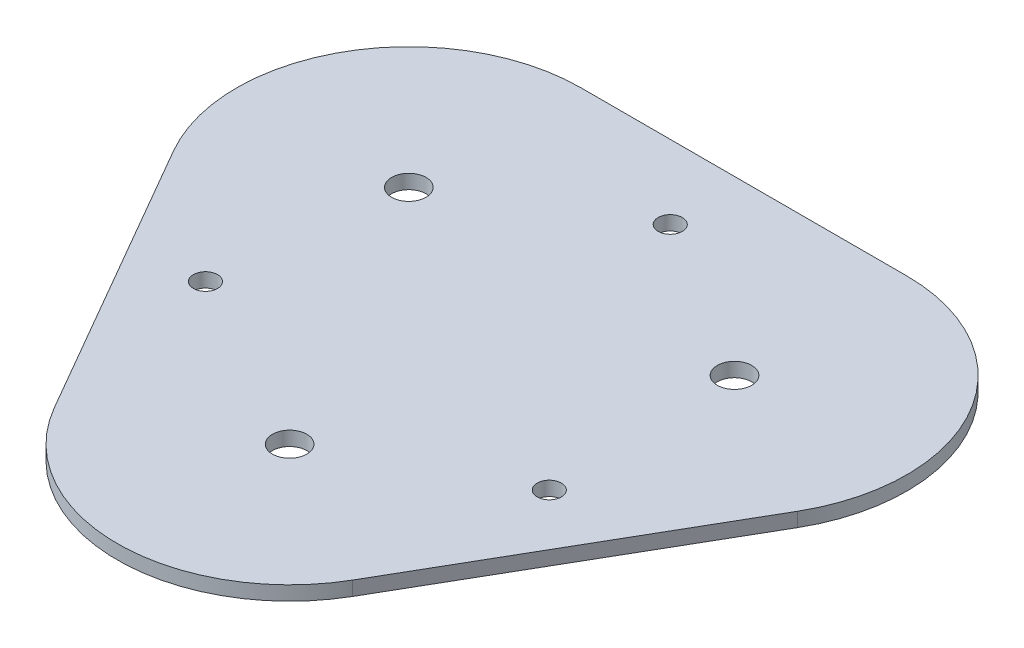
ISO-10303-21;
HEADER;
FILE_DESCRIPTION(('STEP AP214'),'2;1');
FILE_NAME('part.step','',(''),(''),'','','');
FILE_SCHEMA(('AUTOMOTIVE_DESIGN { 1 0 10303 214 1 1 1 1 }'));
ENDSEC;
DATA;
#1=APPLICATION_CONTEXT('core data for automotive mechanical design processes');
#2=APPLICATION_PROTOCOL_DEFINITION('international standard','automotive_design',2000,#1);
#3=PRODUCT_CONTEXT('',#1,'mechanical');
#4=PRODUCT('Part','Part','',(#3));
#5=PRODUCT_RELATED_PRODUCT_CATEGORY('part','',(#4));
#6=PRODUCT_DEFINITION_FORMATION('','',#4);
#7=PRODUCT_DEFINITION_CONTEXT('part definition',#1,'design');
#8=PRODUCT_DEFINITION('design','',#6,#7);
#9=PRODUCT_DEFINITION_SHAPE('','',#8);
#10=(LENGTH_UNIT() NAMED_UNIT(*) SI_UNIT(.MILLI.,.METRE.));
#11=(NAMED_UNIT(*) PLANE_ANGLE_UNIT() SI_UNIT($,.RADIAN.));
#12=(NAMED_UNIT(*) SI_UNIT($,.STERADIAN.) SOLID_ANGLE_UNIT());
#13=UNCERTAINTY_MEASURE_WITH_UNIT(LENGTH_MEASURE(1.E-05),#10,'distance_accuracy_value','');
#14=(GEOMETRIC_REPRESENTATION_CONTEXT(3) GLOBAL_UNCERTAINTY_ASSIGNED_CONTEXT((#13)) GLOBAL_UNIT_ASSIGNED_CONTEXT((#10,
#11,#12)) REPRESENTATION_CONTEXT('',''));
#15=CARTESIAN_POINT('',(0.,0.,0.));
#16=DIRECTION('',(0.,0.,1.));
#17=DIRECTION('',(1.,0.,0.));
#18=AXIS2_PLACEMENT_3D('',#15,#16,#17);
#19=CARTESIAN_POINT('',(-18.9035,1.65,-10.9139408136261));
#20=DIRECTION('',(0.,1.,0.));
#21=DIRECTION('',(0.,0.,1.));
#22=AXIS2_PLACEMENT_3D('',#19,#20,#21);
#23=PLANE('',#22);
#24=CARTESIAN_POINT('',(19.6802540959206,1.65,11.3624));
#25=DIRECTION('',(0.,1.,0.));
#26=DIRECTION('',(0.,0.,1.));
#27=AXIS2_PLACEMENT_3D('',#24,#25,#26);
#28=CIRCLE('',#27,1.4);
#29=CARTESIAN_POINT('',(19.6802540959206,1.65,12.7624));
#30=VERTEX_POINT('',#29);
#31=EDGE_CURVE('E181',#30,#30,#28,.T.);
#32=ORIENTED_EDGE('',*,*,#31,.F.);
#33=EDGE_LOOP('',(#32));
#34=FACE_BOUND('',#33,.T.);
#35=CARTESIAN_POINT('',(0.,1.65,21.8278816272522));
#36=DIRECTION('',(0.,1.,0.));
#37=DIRECTION('',(0.,0.,1.));
#38=AXIS2_PLACEMENT_3D('',#35,#36,#37);
#39=CIRCLE('',#38,2.);
#40=CARTESIAN_POINT('',(0.,1.65,23.8278816272522));
#41=VERTEX_POINT('',#40);
#42=EDGE_CURVE('E169',#41,#41,#39,.T.);
#43=ORIENTED_EDGE('',*,*,#42,.F.);
#44=EDGE_LOOP('',(#43));
#45=FACE_BOUND('',#44,.T.);
#46=CARTESIAN_POINT('',(-18.9035,1.65,-10.9139408136261));
#47=DIRECTION('',(0.,1.,0.));
#48=DIRECTION('',(0.,0.,1.));
#49=AXIS2_PLACEMENT_3D('',#46,#47,#48);
#50=CIRCLE('',#49,2.);
#51=CARTESIAN_POINT('',(-18.9035,1.65,-8.91394081362609));
#52=VERTEX_POINT('',#51);
#53=EDGE_CURVE('E134',#52,#52,#50,.T.);
#54=ORIENTED_EDGE('',*,*,#53,.F.);
#55=EDGE_LOOP('',(#54));
#56=FACE_BOUND('',#55,.T.);
#57=CARTESIAN_POINT('',(-18.9035,1.65,-10.9139408136261));
#58=DIRECTION('',(0.,1.,0.));
#59=DIRECTION('',(0.,0.,1.));
#60=AXIS2_PLACEMENT_3D('',#57,#58,#59);
#61=CIRCLE('',#60,20.);
#62=CARTESIAN_POINT('',(-18.9035,1.65,-30.9139408136261));
#63=VERTEX_POINT('',#62);
#64=CARTESIAN_POINT('',(-36.2240080756888,1.65,-0.913940813626082));
#65=VERTEX_POINT('',#64);
#66=EDGE_CURVE('E142',#63,#65,#61,.T.);
#67=ORIENTED_EDGE('',*,*,#66,.T.);
#68=DIRECTION('',(0.5,0.,0.866025403784438));
#69=VECTOR('',#68,1.);
#70=CARTESIAN_POINT('',(-36.2240080756888,1.65,-0.913940813626082));
#71=LINE('',#70,#69);
#72=CARTESIAN_POINT('',(-17.3205080756888,1.65,31.8278816272522));
#73=VERTEX_POINT('',#72);
#74=EDGE_CURVE('E92',#65,#73,#71,.T.);
#75=ORIENTED_EDGE('',*,*,#74,.T.);
#76=CARTESIAN_POINT('',(0.,1.65,21.8278816272522));
#77=DIRECTION('',(0.,1.,0.));
#78=DIRECTION('',(0.,0.,1.));
#79=AXIS2_PLACEMENT_3D('',#76,#77,#78);
#80=CIRCLE('',#79,20.);
#81=CARTESIAN_POINT('',(17.3205080756888,1.65,31.8278816272522));
#82=VERTEX_POINT('',#81);
#83=EDGE_CURVE('E109',#73,#82,#80,.T.);
#84=ORIENTED_EDGE('',*,*,#83,.T.);
#85=DIRECTION('',(0.5,0.,-0.866025403784439));
#86=VECTOR('',#85,1.);
#87=CARTESIAN_POINT('',(36.2240080756888,1.65,-0.913940813626094));
#88=LINE('',#87,#86);
#89=CARTESIAN_POINT('',(36.2240080756888,1.65,-0.913940813626094));
#90=VERTEX_POINT('',#89);
#91=EDGE_CURVE('E102',#82,#90,#88,.T.);
#92=ORIENTED_EDGE('',*,*,#91,.T.);
#93=CARTESIAN_POINT('',(18.9035,1.65,-10.9139408136261));
#94=DIRECTION('',(0.,1.,0.));
#95=DIRECTION('',(0.,0.,1.));
#96=AXIS2_PLACEMENT_3D('',#93,#94,#95);
#97=CIRCLE('',#96,20.);
#98=CARTESIAN_POINT('',(18.9035,1.65,-30.9139408136261));
#99=VERTEX_POINT('',#98);
#100=EDGE_CURVE('E106',#90,#99,#97,.T.);
#101=ORIENTED_EDGE('',*,*,#100,.T.);
#102=DIRECTION('',(-1.,0.,0.));
#103=VECTOR('',#102,1.);
#104=CARTESIAN_POINT('',(-18.9035,1.65,-30.9139408136261));
#105=LINE('',#104,#103);
#106=EDGE_CURVE('E57',#99,#63,#105,.T.);
#107=ORIENTED_EDGE('',*,*,#106,.T.);
#108=EDGE_LOOP('',(#67,#75,#84,#92,#101,#107));
#109=FACE_BOUND('',#108,.T.);
#110=CARTESIAN_POINT('',(18.9035,1.65,-10.9139408136261));
#111=DIRECTION('',(0.,1.,0.));
#112=DIRECTION('',(0.,0.,1.));
#113=AXIS2_PLACEMENT_3D('',#110,#111,#112);
#114=CIRCLE('',#113,2.);
#115=CARTESIAN_POINT('',(18.9035,1.65,-8.9139408136261));
#116=VERTEX_POINT('',#115);
#117=EDGE_CURVE('E163',#116,#116,#114,.T.);
#118=ORIENTED_EDGE('',*,*,#117,.F.);
#119=EDGE_LOOP('',(#118));
#120=FACE_BOUND('',#119,.T.);
#121=CARTESIAN_POINT('',(-21.2385033140493,1.65,10.358710198626));
#122=DIRECTION('',(0.,1.,0.));
#123=DIRECTION('',(0.,0.,1.));
#124=AXIS2_PLACEMENT_3D('',#121,#122,#123);
#125=CIRCLE('',#124,1.4);
#126=CARTESIAN_POINT('',(-21.2385033140493,1.65,11.758710198626));
#127=VERTEX_POINT('',#126);
#128=EDGE_CURVE('E175',#127,#127,#125,.T.);
#129=ORIENTED_EDGE('',*,*,#128,.F.);
#130=EDGE_LOOP('',(#129));
#131=FACE_BOUND('',#130,.T.);
#132=CARTESIAN_POINT('',(0.,1.65,-22.3558));
#133=DIRECTION('',(0.,1.,0.));
#134=DIRECTION('',(0.,0.,1.));
#135=AXIS2_PLACEMENT_3D('',#132,#133,#134);
#136=CIRCLE('',#135,1.4);
#137=CARTESIAN_POINT('',(0.,1.65,-20.9558));
#138=VERTEX_POINT('',#137);
#139=EDGE_CURVE('E187',#138,#138,#136,.T.);
#140=ORIENTED_EDGE('',*,*,#139,.F.);
#141=EDGE_LOOP('',(#140));
#142=FACE_BOUND('',#141,.T.);
#143=ADVANCED_FACE('F33',(#34,#45,#56,#109,#120,#131,#142),#23,.T.);
#144=CARTESIAN_POINT('',(-18.9035,0.,-10.9139408136261));
#145=DIRECTION('',(0.,1.,0.));
#146=DIRECTION('',(0.,0.,1.));
#147=AXIS2_PLACEMENT_3D('',#144,#145,#146);
#148=PLANE('',#147);
#149=DIRECTION('',(-1.,0.,0.));
#150=VECTOR('',#149,1.);
#151=CARTESIAN_POINT('',(2.5,0.,-1.5));
#152=LINE('',#151,#150);
#153=CARTESIAN_POINT('',(2.5,0.,-1.5));
#154=VERTEX_POINT('',#153);
#155=CARTESIAN_POINT('',(-2.5,0.,-1.5));
#156=VERTEX_POINT('',#155);
#157=EDGE_CURVE('E206',#154,#156,#152,.T.);
#158=ORIENTED_EDGE('',*,*,#157,.T.);
#159=DIRECTION('',(0.,0.,1.));
#160=VECTOR('',#159,1.);
#161=CARTESIAN_POINT('',(-2.5,0.,-1.5));
#162=LINE('',#161,#160);
#163=CARTESIAN_POINT('',(-2.5,0.,1.5));
#164=VERTEX_POINT('',#163);
#165=EDGE_CURVE('E214',#156,#164,#162,.T.);
#166=ORIENTED_EDGE('',*,*,#165,.T.);
#167=DIRECTION('',(1.,0.,0.));
#168=VECTOR('',#167,1.);
#169=CARTESIAN_POINT('',(-2.5,0.,1.5));
#170=LINE('',#169,#168);
#171=CARTESIAN_POINT('',(2.5,0.,1.5));
#172=VERTEX_POINT('',#171);
#173=EDGE_CURVE('E211',#164,#172,#170,.T.);
#174=ORIENTED_EDGE('',*,*,#173,.T.);
#175=DIRECTION('',(0.,0.,-1.));
#176=VECTOR('',#175,1.);
#177=CARTESIAN_POINT('',(2.5,0.,1.5));
#178=LINE('',#177,#176);
#179=EDGE_CURVE('E48',#172,#154,#178,.T.);
#180=ORIENTED_EDGE('',*,*,#179,.T.);
#181=EDGE_LOOP('',(#158,#166,#174,#180));
#182=FACE_BOUND('',#181,.T.);
#183=CARTESIAN_POINT('',(-18.9035,0.,-10.9139408136261));
#184=DIRECTION('',(0.,1.,0.));
#185=DIRECTION('',(0.,0.,1.));
#186=AXIS2_PLACEMENT_3D('',#183,#184,#185);
#187=CIRCLE('',#186,20.);
#188=CARTESIAN_POINT('',(-18.9035,0.,-30.9139408136261));
#189=VERTEX_POINT('',#188);
#190=CARTESIAN_POINT('',(-36.2240080756888,0.,-0.913940813626082));
#191=VERTEX_POINT('',#190);
#192=EDGE_CURVE('E130',#189,#191,#187,.T.);
#193=ORIENTED_EDGE('',*,*,#192,.F.);
#194=DIRECTION('',(-1.,0.,0.));
#195=VECTOR('',#194,1.);
#196=CARTESIAN_POINT('',(-18.9035,0.,-30.9139408136261));
#197=LINE('',#196,#195);
#198=CARTESIAN_POINT('',(18.9035,0.,-30.9139408136261));
#199=VERTEX_POINT('',#198);
#200=EDGE_CURVE('E84',#199,#189,#197,.T.);
#201=ORIENTED_EDGE('',*,*,#200,.F.);
#202=CARTESIAN_POINT('',(18.9035,0.,-10.9139408136261));
#203=DIRECTION('',(0.,1.,0.));
#204=DIRECTION('',(0.,0.,1.));
#205=AXIS2_PLACEMENT_3D('',#202,#203,#204);
#206=CIRCLE('',#205,20.);
#207=CARTESIAN_POINT('',(36.2240080756888,0.,-0.913940813626094));
#208=VERTEX_POINT('',#207);
#209=EDGE_CURVE('E139',#208,#199,#206,.T.);
#210=ORIENTED_EDGE('',*,*,#209,.F.);
#211=DIRECTION('',(0.5,0.,-0.866025403784439));
#212=VECTOR('',#211,1.);
#213=CARTESIAN_POINT('',(36.2240080756888,0.,-0.913940813626094));
#214=LINE('',#213,#212);
#215=CARTESIAN_POINT('',(17.3205080756888,0.,31.8278816272522));
#216=VERTEX_POINT('',#215);
#217=EDGE_CURVE('E118',#216,#208,#214,.T.);
#218=ORIENTED_EDGE('',*,*,#217,.F.);
#219=CARTESIAN_POINT('',(0.,0.,21.8278816272522));
#220=DIRECTION('',(0.,1.,0.));
#221=DIRECTION('',(0.,0.,1.));
#222=AXIS2_PLACEMENT_3D('',#219,#220,#221);
#223=CIRCLE('',#222,20.);
#224=CARTESIAN_POINT('',(-17.3205080756888,0.,31.8278816272522));
#225=VERTEX_POINT('',#224);
#226=EDGE_CURVE('E136',#225,#216,#223,.T.);
#227=ORIENTED_EDGE('',*,*,#226,.F.);
#228=DIRECTION('',(0.5,0.,0.866025403784438));
#229=VECTOR('',#228,1.);
#230=CARTESIAN_POINT('',(-36.2240080756888,0.,-0.913940813626082));
#231=LINE('',#230,#229);
#232=EDGE_CURVE('E133',#191,#225,#231,.T.);
#233=ORIENTED_EDGE('',*,*,#232,.F.);
#234=EDGE_LOOP('',(#193,#201,#210,#218,#227,#233));
#235=FACE_BOUND('',#234,.T.);
#236=CARTESIAN_POINT('',(-18.9035,0.,-10.9139408136261));
#237=DIRECTION('',(0.,1.,0.));
#238=DIRECTION('',(0.,0.,1.));
#239=AXIS2_PLACEMENT_3D('',#236,#237,#238);
#240=CIRCLE('',#239,2.);
#241=CARTESIAN_POINT('',(-18.9035,0.,-8.91394081362609));
#242=VERTEX_POINT('',#241);
#243=EDGE_CURVE('E160',#242,#242,#240,.T.);
#244=ORIENTED_EDGE('',*,*,#243,.T.);
#245=EDGE_LOOP('',(#244));
#246=FACE_BOUND('',#245,.T.);
#247=CARTESIAN_POINT('',(18.9035,0.,-10.9139408136261));
#248=DIRECTION('',(0.,1.,0.));
#249=DIRECTION('',(0.,0.,1.));
#250=AXIS2_PLACEMENT_3D('',#247,#248,#249);
#251=CIRCLE('',#250,2.);
#252=CARTESIAN_POINT('',(18.9035,0.,-8.9139408136261));
#253=VERTEX_POINT('',#252);
#254=EDGE_CURVE('E166',#253,#253,#251,.T.);
#255=ORIENTED_EDGE('',*,*,#254,.T.);
#256=EDGE_LOOP('',(#255));
#257=FACE_BOUND('',#256,.T.);
#258=CARTESIAN_POINT('',(0.,0.,21.8278816272522));
#259=DIRECTION('',(0.,1.,0.));
#260=DIRECTION('',(0.,0.,1.));
#261=AXIS2_PLACEMENT_3D('',#258,#259,#260);
#262=CIRCLE('',#261,2.);
#263=CARTESIAN_POINT('',(0.,0.,23.8278816272522));
#264=VERTEX_POINT('',#263);
#265=EDGE_CURVE('E172',#264,#264,#262,.T.);
#266=ORIENTED_EDGE('',*,*,#265,.T.);
#267=EDGE_LOOP('',(#266));
#268=FACE_BOUND('',#267,.T.);
#269=CARTESIAN_POINT('',(-21.2385033140493,0.,10.358710198626));
#270=DIRECTION('',(0.,1.,0.));
#271=DIRECTION('',(0.,0.,1.));
#272=AXIS2_PLACEMENT_3D('',#269,#270,#271);
#273=CIRCLE('',#272,1.4);
#274=CARTESIAN_POINT('',(-21.2385033140493,0.,11.758710198626));
#275=VERTEX_POINT('',#274);
#276=EDGE_CURVE('E178',#275,#275,#273,.T.);
#277=ORIENTED_EDGE('',*,*,#276,.T.);
#278=EDGE_LOOP('',(#277));
#279=FACE_BOUND('',#278,.T.);
#280=CARTESIAN_POINT('',(19.6802540959206,0.,11.3624));
#281=DIRECTION('',(0.,1.,0.));
#282=DIRECTION('',(0.,0.,1.));
#283=AXIS2_PLACEMENT_3D('',#280,#281,#282);
#284=CIRCLE('',#283,1.4);
#285=CARTESIAN_POINT('',(19.6802540959206,0.,12.7624));
#286=VERTEX_POINT('',#285);
#287=EDGE_CURVE('E184',#286,#286,#284,.T.);
#288=ORIENTED_EDGE('',*,*,#287,.T.);
#289=EDGE_LOOP('',(#288));
#290=FACE_BOUND('',#289,.T.);
#291=CARTESIAN_POINT('',(0.,0.,-22.3558));
#292=DIRECTION('',(0.,1.,0.));
#293=DIRECTION('',(0.,0.,1.));
#294=AXIS2_PLACEMENT_3D('',#291,#292,#293);
#295=CIRCLE('',#294,1.4);
#296=CARTESIAN_POINT('',(0.,0.,-20.9558));
#297=VERTEX_POINT('',#296);
#298=EDGE_CURVE('E190',#297,#297,#295,.T.);
#299=ORIENTED_EDGE('',*,*,#298,.T.);
#300=EDGE_LOOP('',(#299));
#301=FACE_BOUND('',#300,.T.);
#302=ADVANCED_FACE('F151',(#182,#235,#246,#257,#268,#279,#290,#301),#148,.F.);
#303=CARTESIAN_POINT('',(-18.9035,1.65,-10.9139408136261));
#304=DIRECTION('',(0.,-1.,0.));
#305=DIRECTION('',(0.,0.,-1.));
#306=AXIS2_PLACEMENT_3D('',#303,#304,#305);
#307=CYLINDRICAL_SURFACE('',#306,20.);
#308=ORIENTED_EDGE('',*,*,#192,.T.);
#309=DIRECTION('',(0.,-1.,0.));
#310=VECTOR('',#309,1.);
#311=CARTESIAN_POINT('',(-36.2240080756888,1.65,-0.913940813626082));
#312=LINE('',#311,#310);
#313=EDGE_CURVE('E11',#65,#191,#312,.T.);
#314=ORIENTED_EDGE('',*,*,#313,.F.);
#315=ORIENTED_EDGE('',*,*,#66,.F.);
#316=DIRECTION('',(0.,-1.,0.));
#317=VECTOR('',#316,1.);
#318=CARTESIAN_POINT('',(-18.9035,1.65,-30.9139408136261));
#319=LINE('',#318,#317);
#320=EDGE_CURVE('E126',#63,#189,#319,.T.);
#321=ORIENTED_EDGE('',*,*,#320,.T.);
#322=EDGE_LOOP('',(#308,#314,#315,#321));
#323=FACE_BOUND('',#322,.T.);
#324=ADVANCED_FACE('F35',(#323),#307,.T.);
#325=CARTESIAN_POINT('',(-36.2240080756888,1.65,-0.913940813626082));
#326=DIRECTION('',(0.866025403784438,0.,-0.5));
#327=DIRECTION('',(-0.5,0.,-0.866025403784439));
#328=AXIS2_PLACEMENT_3D('',#325,#326,#327);
#329=PLANE('',#328);
#330=ORIENTED_EDGE('',*,*,#232,.T.);
#331=DIRECTION('',(0.,-1.,0.));
#332=VECTOR('',#331,1.);
#333=CARTESIAN_POINT('',(-17.3205080756888,1.65,31.8278816272522));
#334=LINE('',#333,#332);
#335=EDGE_CURVE('E41',#73,#225,#334,.T.);
#336=ORIENTED_EDGE('',*,*,#335,.F.);
#337=ORIENTED_EDGE('',*,*,#74,.F.);
#338=ORIENTED_EDGE('',*,*,#313,.T.);
#339=EDGE_LOOP('',(#330,#336,#337,#338));
#340=FACE_BOUND('',#339,.T.);
#341=ADVANCED_FACE('F262',(#340),#329,.F.);
#342=CARTESIAN_POINT('',(0.,1.65,21.8278816272522));
#343=DIRECTION('',(0.,-1.,0.));
#344=DIRECTION('',(0.,0.,-1.));
#345=AXIS2_PLACEMENT_3D('',#342,#343,#344);
#346=CYLINDRICAL_SURFACE('',#345,20.);
#347=ORIENTED_EDGE('',*,*,#226,.T.);
#348=DIRECTION('',(0.,-1.,0.));
#349=VECTOR('',#348,1.);
#350=CARTESIAN_POINT('',(17.3205080756888,1.65,31.8278816272522));
#351=LINE('',#350,#349);
#352=EDGE_CURVE('E121',#82,#216,#351,.T.);
#353=ORIENTED_EDGE('',*,*,#352,.F.);
#354=ORIENTED_EDGE('',*,*,#83,.F.);
#355=ORIENTED_EDGE('',*,*,#335,.T.);
#356=EDGE_LOOP('',(#347,#353,#354,#355));
#357=FACE_BOUND('',#356,.T.);
#358=ADVANCED_FACE('F148',(#357),#346,.T.);
#359=CARTESIAN_POINT('',(36.2240080756888,1.65,-0.913940813626094));
#360=DIRECTION('',(-0.866025403784439,0.,-0.5));
#361=DIRECTION('',(-0.5,0.,0.866025403784439));
#362=AXIS2_PLACEMENT_3D('',#359,#360,#361);
#363=PLANE('',#362);
#364=ORIENTED_EDGE('',*,*,#217,.T.);
#365=DIRECTION('',(0.,-1.,0.));
#366=VECTOR('',#365,1.);
#367=CARTESIAN_POINT('',(36.2240080756888,1.65,-0.913940813626094));
#368=LINE('',#367,#366);
#369=EDGE_CURVE('E115',#90,#208,#368,.T.);
#370=ORIENTED_EDGE('',*,*,#369,.F.);
#371=ORIENTED_EDGE('',*,*,#91,.F.);
#372=ORIENTED_EDGE('',*,*,#352,.T.);
#373=EDGE_LOOP('',(#364,#370,#371,#372));
#374=FACE_BOUND('',#373,.T.);
#375=ADVANCED_FACE('F116',(#374),#363,.F.);
#376=CARTESIAN_POINT('',(18.9035,1.65,-10.9139408136261));
#377=DIRECTION('',(0.,-1.,0.));
#378=DIRECTION('',(0.,0.,-1.));
#379=AXIS2_PLACEMENT_3D('',#376,#377,#378);
#380=CYLINDRICAL_SURFACE('',#379,20.);
#381=ORIENTED_EDGE('',*,*,#209,.T.);
#382=DIRECTION('',(0.,-1.,0.));
#383=VECTOR('',#382,1.);
#384=CARTESIAN_POINT('',(18.9035,1.65,-30.9139408136261));
#385=LINE('',#384,#383);
#386=EDGE_CURVE('E122',#99,#199,#385,.T.);
#387=ORIENTED_EDGE('',*,*,#386,.F.);
#388=ORIENTED_EDGE('',*,*,#100,.F.);
#389=ORIENTED_EDGE('',*,*,#369,.T.);
#390=EDGE_LOOP('',(#381,#387,#388,#389));
#391=FACE_BOUND('',#390,.T.);
#392=ADVANCED_FACE('F124',(#391),#380,.T.);
#393=CARTESIAN_POINT('',(-18.9035,1.65,-30.9139408136261));
#394=DIRECTION('',(0.,0.,1.));
#395=DIRECTION('',(1.,0.,0.));
#396=AXIS2_PLACEMENT_3D('',#393,#394,#395);
#397=PLANE('',#396);
#398=ORIENTED_EDGE('',*,*,#200,.T.);
#399=ORIENTED_EDGE('',*,*,#320,.F.);
#400=ORIENTED_EDGE('',*,*,#106,.F.);
#401=ORIENTED_EDGE('',*,*,#386,.T.);
#402=EDGE_LOOP('',(#398,#399,#400,#401));
#403=FACE_BOUND('',#402,.T.);
#404=ADVANCED_FACE('F153',(#403),#397,.F.);
#405=CARTESIAN_POINT('',(-18.9035,1.65,-10.9139408136261));
#406=DIRECTION('',(0.,-1.,0.));
#407=DIRECTION('',(0.,0.,-1.));
#408=AXIS2_PLACEMENT_3D('',#405,#406,#407);
#409=CYLINDRICAL_SURFACE('',#408,2.);
#410=ORIENTED_EDGE('',*,*,#53,.T.);
#411=EDGE_LOOP('',(#410));
#412=FACE_BOUND('',#411,.T.);
#413=ORIENTED_EDGE('',*,*,#243,.F.);
#414=EDGE_LOOP('',(#413));
#415=FACE_BOUND('',#414,.T.);
#416=ADVANCED_FACE('F269',(#412,#415),#409,.F.);
#417=CARTESIAN_POINT('',(18.9035,1.65,-10.9139408136261));
#418=DIRECTION('',(0.,-1.,0.));
#419=DIRECTION('',(0.,0.,-1.));
#420=AXIS2_PLACEMENT_3D('',#417,#418,#419);
#421=CYLINDRICAL_SURFACE('',#420,2.);
#422=ORIENTED_EDGE('',*,*,#117,.T.);
#423=EDGE_LOOP('',(#422));
#424=FACE_BOUND('',#423,.T.);
#425=ORIENTED_EDGE('',*,*,#254,.F.);
#426=EDGE_LOOP('',(#425));
#427=FACE_BOUND('',#426,.T.);
#428=ADVANCED_FACE('F302',(#424,#427),#421,.F.);
#429=CARTESIAN_POINT('',(0.,1.65,21.8278816272522));
#430=DIRECTION('',(0.,-1.,0.));
#431=DIRECTION('',(0.,0.,-1.));
#432=AXIS2_PLACEMENT_3D('',#429,#430,#431);
#433=CYLINDRICAL_SURFACE('',#432,2.);
#434=ORIENTED_EDGE('',*,*,#42,.T.);
#435=EDGE_LOOP('',(#434));
#436=FACE_BOUND('',#435,.T.);
#437=ORIENTED_EDGE('',*,*,#265,.F.);
#438=EDGE_LOOP('',(#437));
#439=FACE_BOUND('',#438,.T.);
#440=ADVANCED_FACE('F309',(#436,#439),#433,.F.);
#441=CARTESIAN_POINT('',(-21.2385033140493,1.65,10.358710198626));
#442=DIRECTION('',(0.,-1.,0.));
#443=DIRECTION('',(0.,0.,-1.));
#444=AXIS2_PLACEMENT_3D('',#441,#442,#443);
#445=CYLINDRICAL_SURFACE('',#444,1.4);
#446=ORIENTED_EDGE('',*,*,#128,.T.);
#447=EDGE_LOOP('',(#446));
#448=FACE_BOUND('',#447,.T.);
#449=ORIENTED_EDGE('',*,*,#276,.F.);
#450=EDGE_LOOP('',(#449));
#451=FACE_BOUND('',#450,.T.);
#452=ADVANCED_FACE('F317',(#448,#451),#445,.F.);
#453=CARTESIAN_POINT('',(19.6802540959206,1.65,11.3624));
#454=DIRECTION('',(0.,-1.,0.));
#455=DIRECTION('',(0.,0.,-1.));
#456=AXIS2_PLACEMENT_3D('',#453,#454,#455);
#457=CYLINDRICAL_SURFACE('',#456,1.4);
#458=ORIENTED_EDGE('',*,*,#31,.T.);
#459=EDGE_LOOP('',(#458));
#460=FACE_BOUND('',#459,.T.);
#461=ORIENTED_EDGE('',*,*,#287,.F.);
#462=EDGE_LOOP('',(#461));
#463=FACE_BOUND('',#462,.T.);
#464=ADVANCED_FACE('F325',(#460,#463),#457,.F.);
#465=CARTESIAN_POINT('',(0.,1.65,-22.3558));
#466=DIRECTION('',(0.,-1.,0.));
#467=DIRECTION('',(0.,0.,-1.));
#468=AXIS2_PLACEMENT_3D('',#465,#466,#467);
#469=CYLINDRICAL_SURFACE('',#468,1.4);
#470=ORIENTED_EDGE('',*,*,#139,.T.);
#471=EDGE_LOOP('',(#470));
#472=FACE_BOUND('',#471,.T.);
#473=ORIENTED_EDGE('',*,*,#298,.F.);
#474=EDGE_LOOP('',(#473));
#475=FACE_BOUND('',#474,.T.);
#476=ADVANCED_FACE('F333',(#472,#475),#469,.F.);
#477=CARTESIAN_POINT('',(-2.5,-4.,-1.5));
#478=DIRECTION('',(-1.,0.,0.));
#479=DIRECTION('',(0.,0.,1.));
#480=AXIS2_PLACEMENT_3D('',#477,#478,#479);
#481=PLANE('',#480);
#482=ORIENTED_EDGE('',*,*,#165,.F.);
#483=DIRECTION('',(0.,1.,0.));
#484=VECTOR('',#483,1.);
#485=CARTESIAN_POINT('',(-2.5,-4.,-1.5));
#486=LINE('',#485,#484);
#487=CARTESIAN_POINT('',(-2.5,-4.,-1.5));
#488=VERTEX_POINT('',#487);
#489=EDGE_CURVE('E193',#488,#156,#486,.T.);
#490=ORIENTED_EDGE('',*,*,#489,.F.);
#491=DIRECTION('',(0.,0.,1.));
#492=VECTOR('',#491,1.);
#493=CARTESIAN_POINT('',(-2.5,-4.,-1.5));
#494=LINE('',#493,#492);
#495=CARTESIAN_POINT('',(-2.5,-4.,1.5));
#496=VERTEX_POINT('',#495);
#497=EDGE_CURVE('E209',#488,#496,#494,.T.);
#498=ORIENTED_EDGE('',*,*,#497,.T.);
#499=DIRECTION('',(0.,1.,0.));
#500=VECTOR('',#499,1.);
#501=CARTESIAN_POINT('',(-2.5,-4.,1.5));
#502=LINE('',#501,#500);
#503=EDGE_CURVE('E196',#496,#164,#502,.T.);
#504=ORIENTED_EDGE('',*,*,#503,.T.);
#505=EDGE_LOOP('',(#482,#490,#498,#504));
#506=FACE_BOUND('',#505,.T.);
#507=ADVANCED_FACE('F231',(#506),#481,.T.);
#508=CARTESIAN_POINT('',(2.5,-4.,-1.5));
#509=DIRECTION('',(0.,0.,-1.));
#510=DIRECTION('',(-1.,0.,0.));
#511=AXIS2_PLACEMENT_3D('',#508,#509,#510);
#512=PLANE('',#511);
#513=ORIENTED_EDGE('',*,*,#157,.F.);
#514=DIRECTION('',(0.,1.,0.));
#515=VECTOR('',#514,1.);
#516=CARTESIAN_POINT('',(2.5,-4.,-1.5));
#517=LINE('',#516,#515);
#518=CARTESIAN_POINT('',(2.5,-4.,-1.5));
#519=VERTEX_POINT('',#518);
#520=EDGE_CURVE('E202',#519,#154,#517,.T.);
#521=ORIENTED_EDGE('',*,*,#520,.F.);
#522=DIRECTION('',(-1.,0.,0.));
#523=VECTOR('',#522,1.);
#524=CARTESIAN_POINT('',(2.5,-4.,-1.5));
#525=LINE('',#524,#523);
#526=EDGE_CURVE('E200',#519,#488,#525,.T.);
#527=ORIENTED_EDGE('',*,*,#526,.T.);
#528=ORIENTED_EDGE('',*,*,#489,.T.);
#529=EDGE_LOOP('',(#513,#521,#527,#528));
#530=FACE_BOUND('',#529,.T.);
#531=ADVANCED_FACE('F247',(#530),#512,.T.);
#532=CARTESIAN_POINT('',(2.5,-4.,1.5));
#533=DIRECTION('',(1.,0.,0.));
#534=DIRECTION('',(0.,0.,-1.));
#535=AXIS2_PLACEMENT_3D('',#532,#533,#534);
#536=PLANE('',#535);
#537=ORIENTED_EDGE('',*,*,#179,.F.);
#538=DIRECTION('',(0.,1.,0.));
#539=VECTOR('',#538,1.);
#540=CARTESIAN_POINT('',(2.5,-4.,1.5));
#541=LINE('',#540,#539);
#542=CARTESIAN_POINT('',(2.5,-4.,1.5));
#543=VERTEX_POINT('',#542);
#544=EDGE_CURVE('E199',#543,#172,#541,.T.);
#545=ORIENTED_EDGE('',*,*,#544,.F.);
#546=DIRECTION('',(0.,0.,-1.));
#547=VECTOR('',#546,1.);
#548=CARTESIAN_POINT('',(2.5,-4.,1.5));
#549=LINE('',#548,#547);
#550=EDGE_CURVE('E219',#543,#519,#549,.T.);
#551=ORIENTED_EDGE('',*,*,#550,.T.);
#552=ORIENTED_EDGE('',*,*,#520,.T.);
#553=EDGE_LOOP('',(#537,#545,#551,#552));
#554=FACE_BOUND('',#553,.T.);
#555=ADVANCED_FACE('F250',(#554),#536,.T.);
#556=CARTESIAN_POINT('',(-2.5,-4.,1.5));
#557=DIRECTION('',(0.,0.,1.));
#558=DIRECTION('',(1.,0.,0.));
#559=AXIS2_PLACEMENT_3D('',#556,#557,#558);
#560=PLANE('',#559);
#561=ORIENTED_EDGE('',*,*,#173,.F.);
#562=ORIENTED_EDGE('',*,*,#503,.F.);
#563=DIRECTION('',(1.,0.,0.));
#564=VECTOR('',#563,1.);
#565=CARTESIAN_POINT('',(-2.5,-4.,1.5));
#566=LINE('',#565,#564);
#567=EDGE_CURVE('E222',#496,#543,#566,.T.);
#568=ORIENTED_EDGE('',*,*,#567,.T.);
#569=ORIENTED_EDGE('',*,*,#544,.T.);
#570=EDGE_LOOP('',(#561,#562,#568,#569));
#571=FACE_BOUND('',#570,.T.);
#572=ADVANCED_FACE('F253',(#571),#560,.T.);
#573=CARTESIAN_POINT('',(0.,-4.,0.));
#574=DIRECTION('',(0.,1.,0.));
#575=DIRECTION('',(0.,0.,1.));
#576=AXIS2_PLACEMENT_3D('',#573,#574,#575);
#577=PLANE('',#576);
#578=ORIENTED_EDGE('',*,*,#497,.F.);
#579=ORIENTED_EDGE('',*,*,#526,.F.);
#580=ORIENTED_EDGE('',*,*,#550,.F.);
#581=ORIENTED_EDGE('',*,*,#567,.F.);
#582=EDGE_LOOP('',(#578,#579,#580,#581));
#583=FACE_BOUND('',#582,.T.);
#584=ADVANCED_FACE('F240',(#583),#577,.F.);
#585=CLOSED_SHELL('',(#143,#302,#324,#341,#358,#375,#392,#404,#416,#428,#440,#452,#464,#476,
#507,#531,#555,#572,#584));
#586=MANIFOLD_SOLID_BREP('B2',#585);
#587=ADVANCED_BREP_SHAPE_REPRESENTATION('',(#18,#586),#14);
#588=SHAPE_DEFINITION_REPRESENTATION(#9,#587);
ENDSEC;
END-ISO-10303-21;
